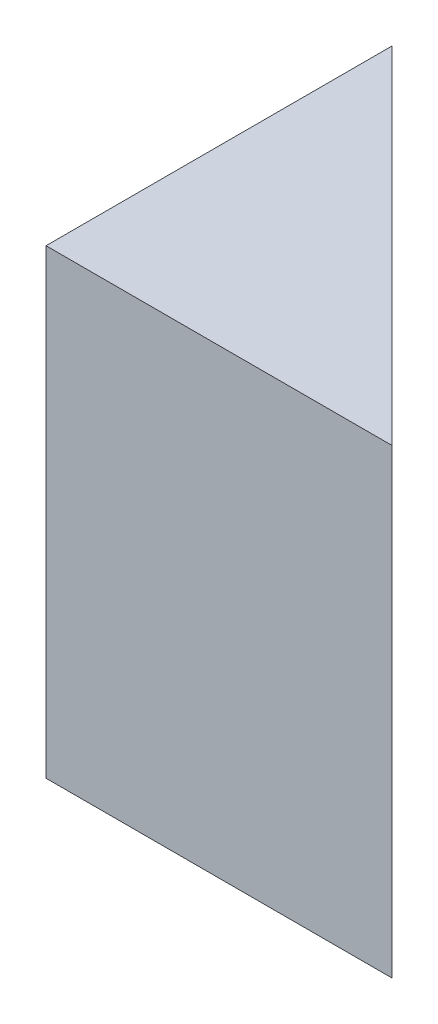
ISO-10303-21;
HEADER;
FILE_DESCRIPTION(('STEP AP214'),'2;1');
FILE_NAME('part.step','',(''),(''),'','','');
FILE_SCHEMA(('AUTOMOTIVE_DESIGN { 1 0 10303 214 1 1 1 1 }'));
ENDSEC;
DATA;
#1=APPLICATION_CONTEXT('core data for automotive mechanical design processes');
#2=APPLICATION_PROTOCOL_DEFINITION('international standard','automotive_design',2000,#1);
#3=PRODUCT_CONTEXT('',#1,'mechanical');
#4=PRODUCT('Part','Part','',(#3));
#5=PRODUCT_RELATED_PRODUCT_CATEGORY('part','',(#4));
#6=PRODUCT_DEFINITION_FORMATION('','',#4);
#7=PRODUCT_DEFINITION_CONTEXT('part definition',#1,'design');
#8=PRODUCT_DEFINITION('design','',#6,#7);
#9=PRODUCT_DEFINITION_SHAPE('','',#8);
#10=(LENGTH_UNIT() NAMED_UNIT(*) SI_UNIT(.MILLI.,.METRE.));
#11=(NAMED_UNIT(*) PLANE_ANGLE_UNIT() SI_UNIT($,.RADIAN.));
#12=(NAMED_UNIT(*) SI_UNIT($,.STERADIAN.) SOLID_ANGLE_UNIT());
#13=UNCERTAINTY_MEASURE_WITH_UNIT(LENGTH_MEASURE(1.E-05),#10,'distance_accuracy_value','');
#14=(GEOMETRIC_REPRESENTATION_CONTEXT(3) GLOBAL_UNCERTAINTY_ASSIGNED_CONTEXT((#13)) GLOBAL_UNIT_ASSIGNED_CONTEXT((#10,
#11,#12)) REPRESENTATION_CONTEXT('',''));
#15=CARTESIAN_POINT('',(0.,0.,0.));
#16=DIRECTION('',(0.,0.,1.));
#17=DIRECTION('',(1.,0.,0.));
#18=AXIS2_PLACEMENT_3D('',#15,#16,#17);
#19=CARTESIAN_POINT('',(19.05,25.4,0.));
#20=DIRECTION('',(-0.707106781186548,0.,0.707106781186548));
#21=DIRECTION('',(0.707106781186548,0.,0.707106781186548));
#22=AXIS2_PLACEMENT_3D('',#19,#20,#21);
#23=PLANE('',#22);
#24=DIRECTION('',(-0.707106781186547,0.,-0.707106781186547));
#25=VECTOR('',#24,1.);
#26=CARTESIAN_POINT('',(19.05,0.,0.));
#27=LINE('',#26,#25);
#28=CARTESIAN_POINT('',(19.05,0.,0.));
#29=VERTEX_POINT('',#28);
#30=CARTESIAN_POINT('',(0.,0.,-19.05));
#31=VERTEX_POINT('',#30);
#32=EDGE_CURVE('E80',#29,#31,#27,.T.);
#33=ORIENTED_EDGE('',*,*,#32,.T.);
#34=DIRECTION('',(0.,-1.,0.));
#35=VECTOR('',#34,1.);
#36=CARTESIAN_POINT('',(0.,25.4,-19.05));
#37=LINE('',#36,#35);
#38=CARTESIAN_POINT('',(0.,25.4,-19.05));
#39=VERTEX_POINT('',#38);
#40=EDGE_CURVE('E11',#39,#31,#37,.T.);
#41=ORIENTED_EDGE('',*,*,#40,.F.);
#42=DIRECTION('',(-0.707106781186547,0.,-0.707106781186547));
#43=VECTOR('',#42,1.);
#44=CARTESIAN_POINT('',(19.05,25.4,0.));
#45=LINE('',#44,#43);
#46=CARTESIAN_POINT('',(19.05,25.4,0.));
#47=VERTEX_POINT('',#46);
#48=EDGE_CURVE('E73',#47,#39,#45,.T.);
#49=ORIENTED_EDGE('',*,*,#48,.F.);
#50=DIRECTION('',(0.,-1.,0.));
#51=VECTOR('',#50,1.);
#52=CARTESIAN_POINT('',(19.05,25.4,0.));
#53=LINE('',#52,#51);
#54=EDGE_CURVE('E81',#47,#29,#53,.T.);
#55=ORIENTED_EDGE('',*,*,#54,.T.);
#56=EDGE_LOOP('',(#33,#41,#49,#55));
#57=FACE_BOUND('',#56,.T.);
#58=ADVANCED_FACE('F33',(#57),#23,.F.);
#59=CARTESIAN_POINT('',(0.,25.4,-19.05));
#60=DIRECTION('',(1.,0.,0.));
#61=DIRECTION('',(0.,0.,-1.));
#62=AXIS2_PLACEMENT_3D('',#59,#60,#61);
#63=PLANE('',#62);
#64=DIRECTION('',(0.,0.,1.));
#65=VECTOR('',#64,1.);
#66=CARTESIAN_POINT('',(0.,0.,-19.05));
#67=LINE('',#66,#65);
#68=CARTESIAN_POINT('',(0.,0.,0.));
#69=VERTEX_POINT('',#68);
#70=EDGE_CURVE('E61',#31,#69,#67,.T.);
#71=ORIENTED_EDGE('',*,*,#70,.T.);
#72=DIRECTION('',(0.,-1.,0.));
#73=VECTOR('',#72,1.);
#74=CARTESIAN_POINT('',(0.,25.4,0.));
#75=LINE('',#74,#73);
#76=CARTESIAN_POINT('',(0.,25.4,0.));
#77=VERTEX_POINT('',#76);
#78=EDGE_CURVE('E41',#77,#69,#75,.T.);
#79=ORIENTED_EDGE('',*,*,#78,.F.);
#80=DIRECTION('',(0.,0.,1.));
#81=VECTOR('',#80,1.);
#82=CARTESIAN_POINT('',(0.,25.4,-19.05));
#83=LINE('',#82,#81);
#84=EDGE_CURVE('E69',#39,#77,#83,.T.);
#85=ORIENTED_EDGE('',*,*,#84,.F.);
#86=ORIENTED_EDGE('',*,*,#40,.T.);
#87=EDGE_LOOP('',(#71,#79,#85,#86));
#88=FACE_BOUND('',#87,.T.);
#89=ADVANCED_FACE('F70',(#88),#63,.F.);
#90=CARTESIAN_POINT('',(0.,25.4,0.));
#91=DIRECTION('',(0.,0.,-1.));
#92=DIRECTION('',(-1.,0.,0.));
#93=AXIS2_PLACEMENT_3D('',#90,#91,#92);
#94=PLANE('',#93);
#95=DIRECTION('',(1.,0.,0.));
#96=VECTOR('',#95,1.);
#97=CARTESIAN_POINT('',(0.,0.,0.));
#98=LINE('',#97,#96);
#99=EDGE_CURVE('E66',#69,#29,#98,.T.);
#100=ORIENTED_EDGE('',*,*,#99,.T.);
#101=ORIENTED_EDGE('',*,*,#54,.F.);
#102=DIRECTION('',(1.,0.,0.));
#103=VECTOR('',#102,1.);
#104=CARTESIAN_POINT('',(0.,25.4,0.));
#105=LINE('',#104,#103);
#106=EDGE_CURVE('E49',#77,#47,#105,.T.);
#107=ORIENTED_EDGE('',*,*,#106,.F.);
#108=ORIENTED_EDGE('',*,*,#78,.T.);
#109=EDGE_LOOP('',(#100,#101,#107,#108));
#110=FACE_BOUND('',#109,.T.);
#111=ADVANCED_FACE('F88',(#110),#94,.F.);
#112=CARTESIAN_POINT('',(0.,25.4,0.));
#113=DIRECTION('',(0.,1.,0.));
#114=DIRECTION('',(0.,0.,1.));
#115=AXIS2_PLACEMENT_3D('',#112,#113,#114);
#116=PLANE('',#115);
#117=ORIENTED_EDGE('',*,*,#48,.T.);
#118=ORIENTED_EDGE('',*,*,#84,.T.);
#119=ORIENTED_EDGE('',*,*,#106,.T.);
#120=EDGE_LOOP('',(#117,#118,#119));
#121=FACE_BOUND('',#120,.T.);
#122=ADVANCED_FACE('F76',(#121),#116,.T.);
#123=CARTESIAN_POINT('',(0.,0.,0.));
#124=DIRECTION('',(0.,1.,0.));
#125=DIRECTION('',(0.,0.,1.));
#126=AXIS2_PLACEMENT_3D('',#123,#124,#125);
#127=PLANE('',#126);
#128=ORIENTED_EDGE('',*,*,#32,.F.);
#129=ORIENTED_EDGE('',*,*,#99,.F.);
#130=ORIENTED_EDGE('',*,*,#70,.F.);
#131=EDGE_LOOP('',(#128,#129,#130));
#132=FACE_BOUND('',#131,.T.);
#133=ADVANCED_FACE('F89',(#132),#127,.F.);
#134=CLOSED_SHELL('',(#58,#89,#111,#122,#133));
#135=MANIFOLD_SOLID_BREP('B2',#134);
#136=ADVANCED_BREP_SHAPE_REPRESENTATION('',(#18,#135),#14);
#137=SHAPE_DEFINITION_REPRESENTATION(#9,#136);
ENDSEC;
END-ISO-10303-21;
